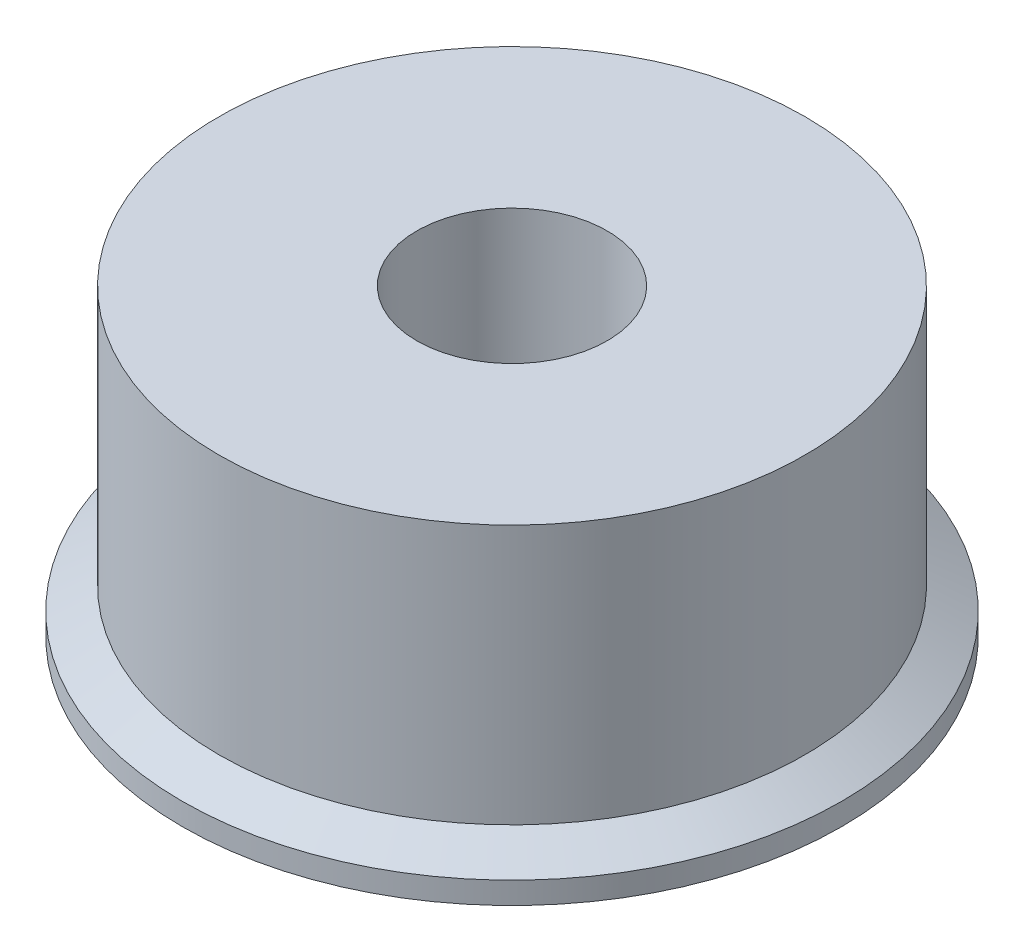
ISO-10303-21;
HEADER;
FILE_DESCRIPTION(('STEP AP214'),'2;1');
FILE_NAME('part.step','',(''),(''),'','','');
FILE_SCHEMA(('AUTOMOTIVE_DESIGN { 1 0 10303 214 1 1 1 1 }'));
ENDSEC;
DATA;
#1=APPLICATION_CONTEXT('core data for automotive mechanical design processes');
#2=APPLICATION_PROTOCOL_DEFINITION('international standard','automotive_design',2000,#1);
#3=PRODUCT_CONTEXT('',#1,'mechanical');
#4=PRODUCT('Part','Part','',(#3));
#5=PRODUCT_RELATED_PRODUCT_CATEGORY('part','',(#4));
#6=PRODUCT_DEFINITION_FORMATION('','',#4);
#7=PRODUCT_DEFINITION_CONTEXT('part definition',#1,'design');
#8=PRODUCT_DEFINITION('design','',#6,#7);
#9=PRODUCT_DEFINITION_SHAPE('','',#8);
#10=(LENGTH_UNIT() NAMED_UNIT(*) SI_UNIT(.MILLI.,.METRE.));
#11=(NAMED_UNIT(*) PLANE_ANGLE_UNIT() SI_UNIT($,.RADIAN.));
#12=(NAMED_UNIT(*) SI_UNIT($,.STERADIAN.) SOLID_ANGLE_UNIT());
#13=UNCERTAINTY_MEASURE_WITH_UNIT(LENGTH_MEASURE(1.E-05),#10,'distance_accuracy_value','');
#14=(GEOMETRIC_REPRESENTATION_CONTEXT(3) GLOBAL_UNCERTAINTY_ASSIGNED_CONTEXT((#13)) GLOBAL_UNIT_ASSIGNED_CONTEXT((#10,
#11,#12)) REPRESENTATION_CONTEXT('',''));
#15=CARTESIAN_POINT('',(0.,0.,0.));
#16=DIRECTION('',(0.,0.,1.));
#17=DIRECTION('',(1.,0.,0.));
#18=AXIS2_PLACEMENT_3D('',#15,#16,#17);
#19=CARTESIAN_POINT('',(0.,7.62,0.));
#20=DIRECTION('',(0.,1.,0.));
#21=DIRECTION('',(0.,0.,1.));
#22=AXIS2_PLACEMENT_3D('',#19,#20,#21);
#23=CYLINDRICAL_SURFACE('',#22,3.302);
#24=CARTESIAN_POINT('',(0.,10.524,0.));
#25=DIRECTION('',(0.,1.,0.));
#26=DIRECTION('',(0.,0.,1.));
#27=AXIS2_PLACEMENT_3D('',#24,#25,#26);
#28=CIRCLE('',#27,3.302);
#29=CARTESIAN_POINT('',(0.,10.524,3.302));
#30=VERTEX_POINT('',#29);
#31=EDGE_CURVE('E10',#30,#30,#28,.T.);
#32=ORIENTED_EDGE('',*,*,#31,.T.);
#33=EDGE_LOOP('',(#32));
#34=FACE_BOUND('',#33,.T.);
#35=CARTESIAN_POINT('',(0.,5.08,0.));
#36=DIRECTION('',(0.,1.,0.));
#37=DIRECTION('',(0.,0.,1.));
#38=AXIS2_PLACEMENT_3D('',#35,#36,#37);
#39=CIRCLE('',#38,3.302);
#40=CARTESIAN_POINT('',(0.,5.08,3.302));
#41=VERTEX_POINT('',#40);
#42=EDGE_CURVE('E63',#41,#41,#39,.T.);
#43=ORIENTED_EDGE('',*,*,#42,.F.);
#44=EDGE_LOOP('',(#43));
#45=FACE_BOUND('',#44,.T.);
#46=ADVANCED_FACE('F35',(#34,#45),#23,.F.);
#47=CARTESIAN_POINT('',(-3.302,10.524,0.));
#48=DIRECTION('',(0.,1.,0.));
#49=DIRECTION('',(0.,0.,1.));
#50=AXIS2_PLACEMENT_3D('',#47,#48,#49);
#51=PLANE('',#50);
#52=CARTESIAN_POINT('',(0.,10.524,0.));
#53=DIRECTION('',(0.,1.,0.));
#54=DIRECTION('',(0.,0.,1.));
#55=AXIS2_PLACEMENT_3D('',#52,#53,#54);
#56=CIRCLE('',#55,10.16);
#57=CARTESIAN_POINT('',(0.,10.524,10.16));
#58=VERTEX_POINT('',#57);
#59=EDGE_CURVE('E41',#58,#58,#56,.T.);
#60=ORIENTED_EDGE('',*,*,#59,.T.);
#61=EDGE_LOOP('',(#60));
#62=FACE_BOUND('',#61,.T.);
#63=ORIENTED_EDGE('',*,*,#31,.F.);
#64=EDGE_LOOP('',(#63));
#65=FACE_BOUND('',#64,.T.);
#66=ADVANCED_FACE('F71',(#62,#65),#51,.T.);
#67=CARTESIAN_POINT('',(0.,7.62,0.));
#68=DIRECTION('',(0.,1.,0.));
#69=DIRECTION('',(0.,0.,1.));
#70=AXIS2_PLACEMENT_3D('',#67,#68,#69);
#71=CYLINDRICAL_SURFACE('',#70,10.16);
#72=CARTESIAN_POINT('',(0.,1.524,0.));
#73=DIRECTION('',(0.,1.,0.));
#74=DIRECTION('',(0.,0.,1.));
#75=AXIS2_PLACEMENT_3D('',#72,#73,#74);
#76=CIRCLE('',#75,10.16);
#77=CARTESIAN_POINT('',(0.,1.524,10.16));
#78=VERTEX_POINT('',#77);
#79=EDGE_CURVE('E45',#78,#78,#76,.T.);
#80=ORIENTED_EDGE('',*,*,#79,.T.);
#81=EDGE_LOOP('',(#80));
#82=FACE_BOUND('',#81,.T.);
#83=ORIENTED_EDGE('',*,*,#59,.F.);
#84=EDGE_LOOP('',(#83));
#85=FACE_BOUND('',#84,.T.);
#86=ADVANCED_FACE('F75',(#82,#85),#71,.T.);
#87=CARTESIAN_POINT('',(0.,1.524,0.));
#88=DIRECTION('',(0.,-1.,0.));
#89=DIRECTION('',(0.,0.,-1.));
#90=AXIS2_PLACEMENT_3D('',#87,#88,#89);
#91=CONICAL_SURFACE('',#90,10.16,1.03037682652431);
#92=CARTESIAN_POINT('',(0.,0.762,0.));
#93=DIRECTION('',(0.,1.,0.));
#94=DIRECTION('',(0.,0.,1.));
#95=AXIS2_PLACEMENT_3D('',#92,#93,#94);
#96=CIRCLE('',#95,11.43);
#97=CARTESIAN_POINT('',(0.,0.762,11.43));
#98=VERTEX_POINT('',#97);
#99=EDGE_CURVE('E49',#98,#98,#96,.T.);
#100=ORIENTED_EDGE('',*,*,#99,.T.);
#101=EDGE_LOOP('',(#100));
#102=FACE_BOUND('',#101,.T.);
#103=ORIENTED_EDGE('',*,*,#79,.F.);
#104=EDGE_LOOP('',(#103));
#105=FACE_BOUND('',#104,.T.);
#106=ADVANCED_FACE('F79',(#102,#105),#91,.T.);
#107=CARTESIAN_POINT('',(0.,7.62,0.));
#108=DIRECTION('',(0.,1.,0.));
#109=DIRECTION('',(0.,0.,1.));
#110=AXIS2_PLACEMENT_3D('',#107,#108,#109);
#111=CYLINDRICAL_SURFACE('',#110,11.43);
#112=CARTESIAN_POINT('',(0.,0.,0.));
#113=DIRECTION('',(0.,1.,0.));
#114=DIRECTION('',(0.,0.,1.));
#115=AXIS2_PLACEMENT_3D('',#112,#113,#114);
#116=CIRCLE('',#115,11.43);
#117=CARTESIAN_POINT('',(0.,0.,11.43));
#118=VERTEX_POINT('',#117);
#119=EDGE_CURVE('E54',#118,#118,#116,.T.);
#120=ORIENTED_EDGE('',*,*,#119,.T.);
#121=EDGE_LOOP('',(#120));
#122=FACE_BOUND('',#121,.T.);
#123=ORIENTED_EDGE('',*,*,#99,.F.);
#124=EDGE_LOOP('',(#123));
#125=FACE_BOUND('',#124,.T.);
#126=ADVANCED_FACE('F86',(#122,#125),#111,.T.);
#127=CARTESIAN_POINT('',(-11.43,0.,0.));
#128=DIRECTION('',(0.,-1.,0.));
#129=DIRECTION('',(0.,0.,-1.));
#130=AXIS2_PLACEMENT_3D('',#127,#128,#129);
#131=PLANE('',#130);
#132=CARTESIAN_POINT('',(0.,0.,0.));
#133=DIRECTION('',(0.,1.,0.));
#134=DIRECTION('',(0.,0.,1.));
#135=AXIS2_PLACEMENT_3D('',#132,#133,#134);
#136=CIRCLE('',#135,7.9375);
#137=CARTESIAN_POINT('',(0.,0.,7.9375));
#138=VERTEX_POINT('',#137);
#139=EDGE_CURVE('E57',#138,#138,#136,.T.);
#140=ORIENTED_EDGE('',*,*,#139,.T.);
#141=EDGE_LOOP('',(#140));
#142=FACE_BOUND('',#141,.T.);
#143=ORIENTED_EDGE('',*,*,#119,.F.);
#144=EDGE_LOOP('',(#143));
#145=FACE_BOUND('',#144,.T.);
#146=ADVANCED_FACE('F90',(#142,#145),#131,.T.);
#147=CARTESIAN_POINT('',(0.,7.62,0.));
#148=DIRECTION('',(0.,1.,0.));
#149=DIRECTION('',(0.,0.,1.));
#150=AXIS2_PLACEMENT_3D('',#147,#148,#149);
#151=CYLINDRICAL_SURFACE('',#150,7.9375);
#152=CARTESIAN_POINT('',(0.,5.08,0.));
#153=DIRECTION('',(0.,1.,0.));
#154=DIRECTION('',(0.,0.,1.));
#155=AXIS2_PLACEMENT_3D('',#152,#153,#154);
#156=CIRCLE('',#155,7.9375);
#157=CARTESIAN_POINT('',(0.,5.08,7.9375));
#158=VERTEX_POINT('',#157);
#159=EDGE_CURVE('E60',#158,#158,#156,.T.);
#160=ORIENTED_EDGE('',*,*,#159,.T.);
#161=EDGE_LOOP('',(#160));
#162=FACE_BOUND('',#161,.T.);
#163=ORIENTED_EDGE('',*,*,#139,.F.);
#164=EDGE_LOOP('',(#163));
#165=FACE_BOUND('',#164,.T.);
#166=ADVANCED_FACE('F94',(#162,#165),#151,.F.);
#167=CARTESIAN_POINT('',(-7.9375,5.08,0.));
#168=DIRECTION('',(0.,-1.,0.));
#169=DIRECTION('',(0.,0.,-1.));
#170=AXIS2_PLACEMENT_3D('',#167,#168,#169);
#171=PLANE('',#170);
#172=ORIENTED_EDGE('',*,*,#42,.T.);
#173=EDGE_LOOP('',(#172));
#174=FACE_BOUND('',#173,.T.);
#175=ORIENTED_EDGE('',*,*,#159,.F.);
#176=EDGE_LOOP('',(#175));
#177=FACE_BOUND('',#176,.T.);
#178=ADVANCED_FACE('F67',(#174,#177),#171,.T.);
#179=CLOSED_SHELL('',(#46,#66,#86,#106,#126,#146,#166,#178));
#180=MANIFOLD_SOLID_BREP('B2',#179);
#181=ADVANCED_BREP_SHAPE_REPRESENTATION('',(#18,#180),#14);
#182=SHAPE_DEFINITION_REPRESENTATION(#9,#181);
ENDSEC;
END-ISO-10303-21;
